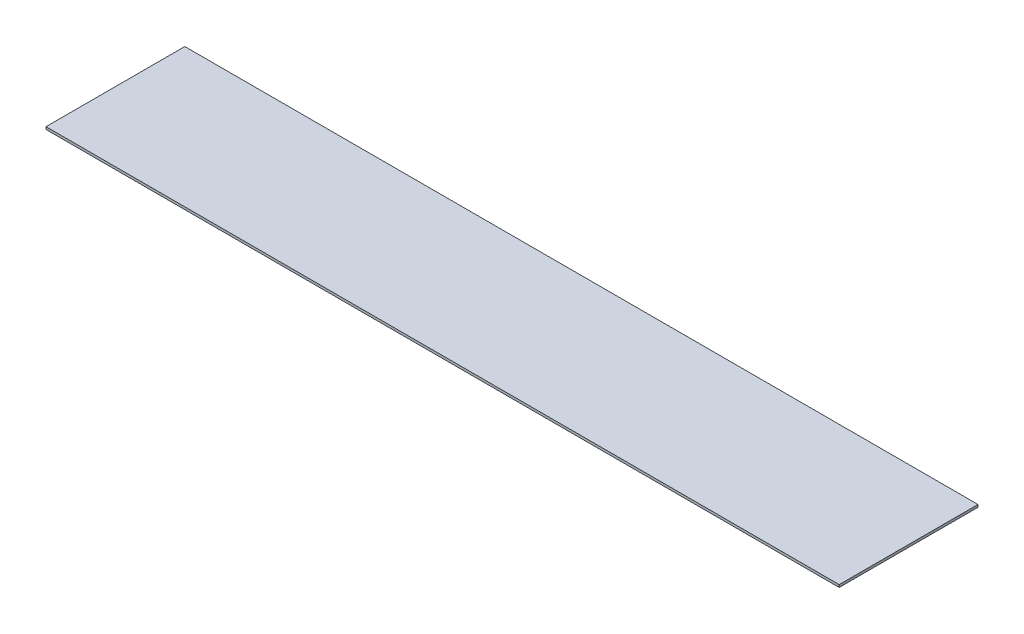
ISO-10303-21;
HEADER;
FILE_DESCRIPTION(('STEP AP214'),'2;1');
FILE_NAME('part.step','',(''),(''),'','','');
FILE_SCHEMA(('AUTOMOTIVE_DESIGN { 1 0 10303 214 1 1 1 1 }'));
ENDSEC;
DATA;
#1=APPLICATION_CONTEXT('core data for automotive mechanical design processes');
#2=APPLICATION_PROTOCOL_DEFINITION('international standard','automotive_design',2000,#1);
#3=PRODUCT_CONTEXT('',#1,'mechanical');
#4=PRODUCT('Part','Part','',(#3));
#5=PRODUCT_RELATED_PRODUCT_CATEGORY('part','',(#4));
#6=PRODUCT_DEFINITION_FORMATION('','',#4);
#7=PRODUCT_DEFINITION_CONTEXT('part definition',#1,'design');
#8=PRODUCT_DEFINITION('design','',#6,#7);
#9=PRODUCT_DEFINITION_SHAPE('','',#8);
#10=(LENGTH_UNIT() NAMED_UNIT(*) SI_UNIT(.MILLI.,.METRE.));
#11=(NAMED_UNIT(*) PLANE_ANGLE_UNIT() SI_UNIT($,.RADIAN.));
#12=(NAMED_UNIT(*) SI_UNIT($,.STERADIAN.) SOLID_ANGLE_UNIT());
#13=UNCERTAINTY_MEASURE_WITH_UNIT(LENGTH_MEASURE(1.E-05),#10,'distance_accuracy_value','');
#14=(GEOMETRIC_REPRESENTATION_CONTEXT(3) GLOBAL_UNCERTAINTY_ASSIGNED_CONTEXT((#13)) GLOBAL_UNIT_ASSIGNED_CONTEXT((#10,
#11,#12)) REPRESENTATION_CONTEXT('',''));
#15=CARTESIAN_POINT('',(0.,0.,0.));
#16=DIRECTION('',(0.,0.,1.));
#17=DIRECTION('',(1.,0.,0.));
#18=AXIS2_PLACEMENT_3D('',#15,#16,#17);
#19=CARTESIAN_POINT('',(253.999999999999,1.5875,44.45));
#20=DIRECTION('',(-1.,0.,0.));
#21=DIRECTION('',(0.,0.,1.));
#22=AXIS2_PLACEMENT_3D('',#19,#20,#21);
#23=PLANE('',#22);
#24=DIRECTION('',(0.,0.,-1.));
#25=VECTOR('',#24,1.);
#26=CARTESIAN_POINT('',(253.999999999999,0.,44.45));
#27=LINE('',#26,#25);
#28=CARTESIAN_POINT('',(253.999999999999,0.,44.45));
#29=VERTEX_POINT('',#28);
#30=CARTESIAN_POINT('',(253.999999999999,0.,-44.45));
#31=VERTEX_POINT('',#30);
#32=EDGE_CURVE('E97',#29,#31,#27,.T.);
#33=ORIENTED_EDGE('',*,*,#32,.T.);
#34=DIRECTION('',(0.,-1.,0.));
#35=VECTOR('',#34,1.);
#36=CARTESIAN_POINT('',(253.999999999999,1.5875,-44.45));
#37=LINE('',#36,#35);
#38=CARTESIAN_POINT('',(253.999999999999,1.5875,-44.45));
#39=VERTEX_POINT('',#38);
#40=EDGE_CURVE('E11',#39,#31,#37,.T.);
#41=ORIENTED_EDGE('',*,*,#40,.F.);
#42=DIRECTION('',(0.,0.,-1.));
#43=VECTOR('',#42,1.);
#44=CARTESIAN_POINT('',(253.999999999999,1.5875,44.45));
#45=LINE('',#44,#43);
#46=CARTESIAN_POINT('',(253.999999999999,1.5875,44.45));
#47=VERTEX_POINT('',#46);
#48=EDGE_CURVE('E85',#47,#39,#45,.T.);
#49=ORIENTED_EDGE('',*,*,#48,.F.);
#50=DIRECTION('',(0.,-1.,0.));
#51=VECTOR('',#50,1.);
#52=CARTESIAN_POINT('',(253.999999999999,1.5875,44.45));
#53=LINE('',#52,#51);
#54=EDGE_CURVE('E93',#47,#29,#53,.T.);
#55=ORIENTED_EDGE('',*,*,#54,.T.);
#56=EDGE_LOOP('',(#33,#41,#49,#55));
#57=FACE_BOUND('',#56,.T.);
#58=ADVANCED_FACE('F34',(#57),#23,.F.);
#59=CARTESIAN_POINT('',(-254.000000000001,1.5875,-44.45));
#60=DIRECTION('',(0.,0.,1.));
#61=DIRECTION('',(1.,0.,0.));
#62=AXIS2_PLACEMENT_3D('',#59,#60,#61);
#63=PLANE('',#62);
#64=DIRECTION('',(-1.,0.,0.));
#65=VECTOR('',#64,1.);
#66=CARTESIAN_POINT('',(-254.000000000001,0.,-44.45));
#67=LINE('',#66,#65);
#68=CARTESIAN_POINT('',(-254.000000000001,0.,-44.45));
#69=VERTEX_POINT('',#68);
#70=EDGE_CURVE('E89',#31,#69,#67,.T.);
#71=ORIENTED_EDGE('',*,*,#70,.T.);
#72=DIRECTION('',(0.,-1.,0.));
#73=VECTOR('',#72,1.);
#74=CARTESIAN_POINT('',(-254.000000000001,1.5875,-44.45));
#75=LINE('',#74,#73);
#76=CARTESIAN_POINT('',(-254.000000000001,1.5875,-44.45));
#77=VERTEX_POINT('',#76);
#78=EDGE_CURVE('E42',#77,#69,#75,.T.);
#79=ORIENTED_EDGE('',*,*,#78,.F.);
#80=DIRECTION('',(-1.,0.,0.));
#81=VECTOR('',#80,1.);
#82=CARTESIAN_POINT('',(-254.000000000001,1.5875,-44.45));
#83=LINE('',#82,#81);
#84=EDGE_CURVE('E80',#39,#77,#83,.T.);
#85=ORIENTED_EDGE('',*,*,#84,.F.);
#86=ORIENTED_EDGE('',*,*,#40,.T.);
#87=EDGE_LOOP('',(#71,#79,#85,#86));
#88=FACE_BOUND('',#87,.T.);
#89=ADVANCED_FACE('F88',(#88),#63,.F.);
#90=CARTESIAN_POINT('',(-254.000000000001,1.5875,44.45));
#91=DIRECTION('',(1.,0.,0.));
#92=DIRECTION('',(0.,0.,-1.));
#93=AXIS2_PLACEMENT_3D('',#90,#91,#92);
#94=PLANE('',#93);
#95=DIRECTION('',(0.,0.,1.));
#96=VECTOR('',#95,1.);
#97=CARTESIAN_POINT('',(-254.000000000001,0.,44.45));
#98=LINE('',#97,#96);
#99=CARTESIAN_POINT('',(-254.000000000001,0.,44.45));
#100=VERTEX_POINT('',#99);
#101=EDGE_CURVE('E67',#69,#100,#98,.T.);
#102=ORIENTED_EDGE('',*,*,#101,.T.);
#103=DIRECTION('',(0.,-1.,0.));
#104=VECTOR('',#103,1.);
#105=CARTESIAN_POINT('',(-254.000000000001,1.5875,44.45));
#106=LINE('',#105,#104);
#107=CARTESIAN_POINT('',(-254.000000000001,1.5875,44.45));
#108=VERTEX_POINT('',#107);
#109=EDGE_CURVE('E90',#108,#100,#106,.T.);
#110=ORIENTED_EDGE('',*,*,#109,.F.);
#111=DIRECTION('',(0.,0.,1.));
#112=VECTOR('',#111,1.);
#113=CARTESIAN_POINT('',(-254.000000000001,1.5875,44.45));
#114=LINE('',#113,#112);
#115=EDGE_CURVE('E83',#77,#108,#114,.T.);
#116=ORIENTED_EDGE('',*,*,#115,.F.);
#117=ORIENTED_EDGE('',*,*,#78,.T.);
#118=EDGE_LOOP('',(#102,#110,#116,#117));
#119=FACE_BOUND('',#118,.T.);
#120=ADVANCED_FACE('F91',(#119),#94,.F.);
#121=CARTESIAN_POINT('',(-254.000000000001,1.5875,44.45));
#122=DIRECTION('',(0.,0.,-1.));
#123=DIRECTION('',(-1.,0.,0.));
#124=AXIS2_PLACEMENT_3D('',#121,#122,#123);
#125=PLANE('',#124);
#126=DIRECTION('',(1.,0.,0.));
#127=VECTOR('',#126,1.);
#128=CARTESIAN_POINT('',(-254.000000000001,0.,44.45));
#129=LINE('',#128,#127);
#130=EDGE_CURVE('E73',#100,#29,#129,.T.);
#131=ORIENTED_EDGE('',*,*,#130,.T.);
#132=ORIENTED_EDGE('',*,*,#54,.F.);
#133=DIRECTION('',(1.,0.,0.));
#134=VECTOR('',#133,1.);
#135=CARTESIAN_POINT('',(-254.000000000001,1.5875,44.45));
#136=LINE('',#135,#134);
#137=EDGE_CURVE('E50',#108,#47,#136,.T.);
#138=ORIENTED_EDGE('',*,*,#137,.F.);
#139=ORIENTED_EDGE('',*,*,#109,.T.);
#140=EDGE_LOOP('',(#131,#132,#138,#139));
#141=FACE_BOUND('',#140,.T.);
#142=ADVANCED_FACE('F104',(#141),#125,.F.);
#143=CARTESIAN_POINT('',(0.,1.5875,0.));
#144=DIRECTION('',(0.,-1.,0.));
#145=DIRECTION('',(0.,0.,-1.));
#146=AXIS2_PLACEMENT_3D('',#143,#144,#145);
#147=PLANE('',#146);
#148=ORIENTED_EDGE('',*,*,#48,.T.);
#149=ORIENTED_EDGE('',*,*,#84,.T.);
#150=ORIENTED_EDGE('',*,*,#115,.T.);
#151=ORIENTED_EDGE('',*,*,#137,.T.);
#152=EDGE_LOOP('',(#148,#149,#150,#151));
#153=FACE_BOUND('',#152,.T.);
#154=ADVANCED_FACE('F81',(#153),#147,.F.);
#155=CARTESIAN_POINT('',(0.,0.,0.));
#156=DIRECTION('',(0.,-1.,0.));
#157=DIRECTION('',(0.,0.,-1.));
#158=AXIS2_PLACEMENT_3D('',#155,#156,#157);
#159=PLANE('',#158);
#160=ORIENTED_EDGE('',*,*,#32,.F.);
#161=ORIENTED_EDGE('',*,*,#130,.F.);
#162=ORIENTED_EDGE('',*,*,#101,.F.);
#163=ORIENTED_EDGE('',*,*,#70,.F.);
#164=EDGE_LOOP('',(#160,#161,#162,#163));
#165=FACE_BOUND('',#164,.T.);
#166=ADVANCED_FACE('F107',(#165),#159,.T.);
#167=CLOSED_SHELL('',(#58,#89,#120,#142,#154,#166));
#168=MANIFOLD_SOLID_BREP('B2',#167);
#169=ADVANCED_BREP_SHAPE_REPRESENTATION('',(#18,#168),#14);
#170=SHAPE_DEFINITION_REPRESENTATION(#9,#169);
ENDSEC;
END-ISO-10303-21;
